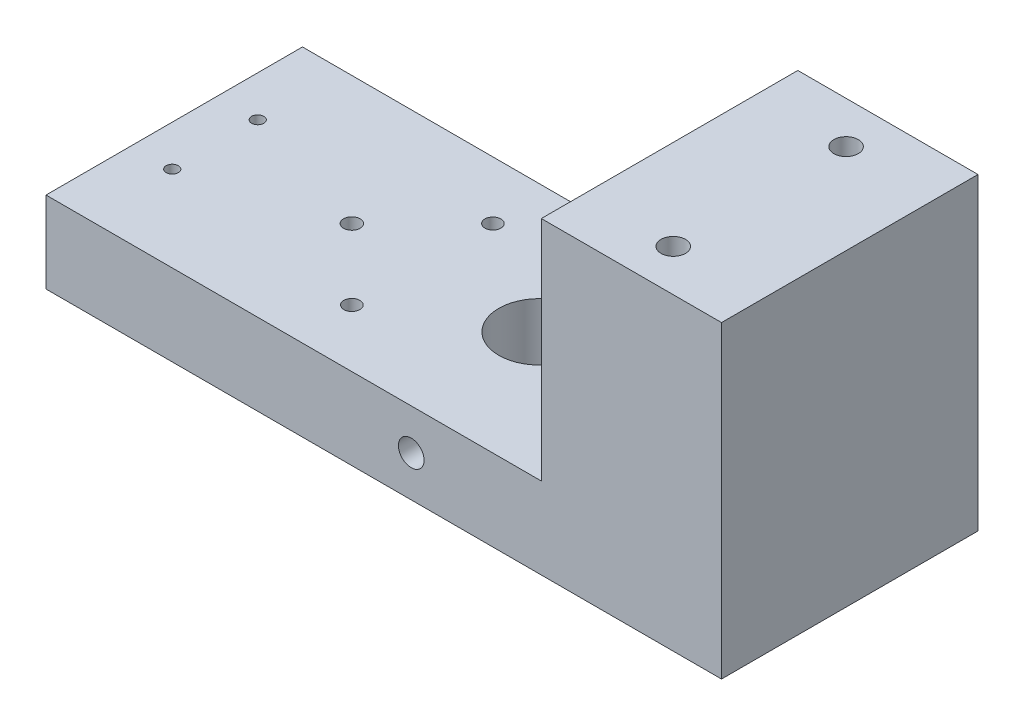
ISO-10303-21;
HEADER;
FILE_DESCRIPTION(('STEP AP214'),'2;1');
FILE_NAME('part.step','',(''),(''),'','','');
FILE_SCHEMA(('AUTOMOTIVE_DESIGN { 1 0 10303 214 1 1 1 1 }'));
ENDSEC;
DATA;
#1=APPLICATION_CONTEXT('core data for automotive mechanical design processes');
#2=APPLICATION_PROTOCOL_DEFINITION('international standard','automotive_design',2000,#1);
#3=PRODUCT_CONTEXT('',#1,'mechanical');
#4=PRODUCT('Part','Part','',(#3));
#5=PRODUCT_RELATED_PRODUCT_CATEGORY('part','',(#4));
#6=PRODUCT_DEFINITION_FORMATION('','',#4);
#7=PRODUCT_DEFINITION_CONTEXT('part definition',#1,'design');
#8=PRODUCT_DEFINITION('design','',#6,#7);
#9=PRODUCT_DEFINITION_SHAPE('','',#8);
#10=(LENGTH_UNIT() NAMED_UNIT(*) SI_UNIT(.MILLI.,.METRE.));
#11=(NAMED_UNIT(*) PLANE_ANGLE_UNIT() SI_UNIT($,.RADIAN.));
#12=(NAMED_UNIT(*) SI_UNIT($,.STERADIAN.) SOLID_ANGLE_UNIT());
#13=UNCERTAINTY_MEASURE_WITH_UNIT(LENGTH_MEASURE(1.E-05),#10,'distance_accuracy_value','');
#14=(GEOMETRIC_REPRESENTATION_CONTEXT(3) GLOBAL_UNCERTAINTY_ASSIGNED_CONTEXT((#13)) GLOBAL_UNIT_ASSIGNED_CONTEXT((#10,
#11,#12)) REPRESENTATION_CONTEXT('',''));
#15=CARTESIAN_POINT('',(0.,0.,0.));
#16=DIRECTION('',(0.,0.,1.));
#17=DIRECTION('',(1.,0.,0.));
#18=AXIS2_PLACEMENT_3D('',#15,#16,#17);
#19=CARTESIAN_POINT('',(105.35,-10.8163637357097,28.0311398221209));
#20=DIRECTION('',(0.,1.,0.));
#21=DIRECTION('',(0.,0.,1.));
#22=AXIS2_PLACEMENT_3D('',#19,#20,#21);
#23=PLANE('',#22);
#24=CARTESIAN_POINT('',(6.35,-10.8163637357097,1.36413982212091));
#25=DIRECTION('',(0.,-1.,0.));
#26=DIRECTION('',(0.,0.,-1.));
#27=AXIS2_PLACEMENT_3D('',#24,#25,#26);
#28=CIRCLE('',#27,0.949999999999999);
#29=CARTESIAN_POINT('',(6.35,-10.8163637357097,0.414139822120907));
#30=VERTEX_POINT('',#29);
#31=EDGE_CURVE('E210',#30,#30,#28,.T.);
#32=ORIENTED_EDGE('',*,*,#31,.F.);
#33=EDGE_LOOP('',(#32));
#34=FACE_BOUND('',#33,.T.);
#35=CARTESIAN_POINT('',(6.35,-10.8163637357097,14.6981398221209));
#36=DIRECTION('',(0.,-1.,0.));
#37=DIRECTION('',(0.,0.,-1.));
#38=AXIS2_PLACEMENT_3D('',#35,#36,#37);
#39=CIRCLE('',#38,0.949999999999999);
#40=CARTESIAN_POINT('',(6.35,-10.8163637357097,13.7481398221209));
#41=VERTEX_POINT('',#40);
#42=EDGE_CURVE('E199',#41,#41,#39,.T.);
#43=ORIENTED_EDGE('',*,*,#42,.F.);
#44=EDGE_LOOP('',(#43));
#45=FACE_BOUND('',#44,.T.);
#46=CARTESIAN_POINT('',(91.3,-10.8163637357097,21.5058398221209));
#47=DIRECTION('',(0.,1.,0.));
#48=DIRECTION('',(0.,0.,1.));
#49=AXIS2_PLACEMENT_3D('',#46,#47,#48);
#50=CIRCLE('',#49,3.75000000000001);
#51=CARTESIAN_POINT('',(91.3,-10.8163637357097,25.2558398221209));
#52=VERTEX_POINT('',#51);
#53=EDGE_CURVE('E188',#52,#52,#50,.T.);
#54=ORIENTED_EDGE('',*,*,#53,.T.);
#55=EDGE_LOOP('',(#54));
#56=FACE_BOUND('',#55,.T.);
#57=CARTESIAN_POINT('',(38.7,-10.8163637357097,19.0311398221209));
#58=DIRECTION('',(0.,1.,0.));
#59=DIRECTION('',(0.,0.,1.));
#60=AXIS2_PLACEMENT_3D('',#57,#58,#59);
#61=CIRCLE('',#60,1.25);
#62=CARTESIAN_POINT('',(38.7,-10.8163637357097,20.2811398221209));
#63=VERTEX_POINT('',#62);
#64=EDGE_CURVE('E136',#63,#63,#61,.T.);
#65=ORIENTED_EDGE('',*,*,#64,.T.);
#66=EDGE_LOOP('',(#65));
#67=FACE_BOUND('',#66,.T.);
#68=CARTESIAN_POINT('',(38.7,-10.8163637357097,-2.96886017787909));
#69=DIRECTION('',(0.,1.,0.));
#70=DIRECTION('',(0.,0.,1.));
#71=AXIS2_PLACEMENT_3D('',#68,#69,#70);
#72=CIRCLE('',#71,1.25);
#73=CARTESIAN_POINT('',(38.7,-10.8163637357097,-1.71886017787909));
#74=VERTEX_POINT('',#73);
#75=EDGE_CURVE('E144',#74,#74,#72,.T.);
#76=ORIENTED_EDGE('',*,*,#75,.T.);
#77=EDGE_LOOP('',(#76));
#78=FACE_BOUND('',#77,.T.);
#79=CARTESIAN_POINT('',(27.7,-10.8163637357097,8.03113982212091));
#80=DIRECTION('',(0.,1.,0.));
#81=DIRECTION('',(0.,0.,1.));
#82=AXIS2_PLACEMENT_3D('',#79,#80,#81);
#83=CIRCLE('',#82,1.29151989841485);
#84=CARTESIAN_POINT('',(27.7,-10.8163637357097,9.32265972053576));
#85=VERTEX_POINT('',#84);
#86=EDGE_CURVE('E150',#85,#85,#83,.T.);
#87=ORIENTED_EDGE('',*,*,#86,.T.);
#88=EDGE_LOOP('',(#87));
#89=FACE_BOUND('',#88,.T.);
#90=CARTESIAN_POINT('',(56.96,-10.8163637357097,8.03113982212091));
#91=DIRECTION('',(0.,1.,0.));
#92=DIRECTION('',(0.,0.,1.));
#93=AXIS2_PLACEMENT_3D('',#90,#91,#92);
#94=CIRCLE('',#93,6.35000000000003);
#95=CARTESIAN_POINT('',(56.96,-10.8163637357097,14.3811398221209));
#96=VERTEX_POINT('',#95);
#97=EDGE_CURVE('E102',#96,#96,#94,.T.);
#98=ORIENTED_EDGE('',*,*,#97,.T.);
#99=EDGE_LOOP('',(#98));
#100=FACE_BOUND('',#99,.T.);
#101=DIRECTION('',(0.,0.,-1.));
#102=VECTOR('',#101,1.);
#103=CARTESIAN_POINT('',(0.,-10.8163637357097,28.0311398221209));
#104=LINE('',#103,#102);
#105=CARTESIAN_POINT('',(0.,-10.8163637357097,28.0311398221209));
#106=VERTEX_POINT('',#105);
#107=CARTESIAN_POINT('',(0.,-10.8163637357097,-11.9688601778791));
#108=VERTEX_POINT('',#107);
#109=EDGE_CURVE('E101',#106,#108,#104,.T.);
#110=ORIENTED_EDGE('',*,*,#109,.T.);
#111=DIRECTION('',(-1.,0.,0.));
#112=VECTOR('',#111,1.);
#113=CARTESIAN_POINT('',(105.35,-10.8163637357097,-11.9688601778791));
#114=LINE('',#113,#112);
#115=CARTESIAN_POINT('',(105.35,-10.8163637357097,-11.9688601778791));
#116=VERTEX_POINT('',#115);
#117=EDGE_CURVE('E44',#116,#108,#114,.T.);
#118=ORIENTED_EDGE('',*,*,#117,.F.);
#119=DIRECTION('',(0.,0.,-1.));
#120=VECTOR('',#119,1.);
#121=CARTESIAN_POINT('',(105.35,-10.8163637357097,28.0311398221209));
#122=LINE('',#121,#120);
#123=CARTESIAN_POINT('',(105.35,-10.8163637357097,28.0311398221209));
#124=VERTEX_POINT('',#123);
#125=EDGE_CURVE('E61',#124,#116,#122,.T.);
#126=ORIENTED_EDGE('',*,*,#125,.F.);
#127=DIRECTION('',(-1.,0.,0.));
#128=VECTOR('',#127,1.);
#129=CARTESIAN_POINT('',(105.35,-10.8163637357097,28.0311398221209));
#130=LINE('',#129,#128);
#131=EDGE_CURVE('E12',#124,#106,#130,.T.);
#132=ORIENTED_EDGE('',*,*,#131,.T.);
#133=EDGE_LOOP('',(#110,#118,#126,#132));
#134=FACE_BOUND('',#133,.T.);
#135=CARTESIAN_POINT('',(91.3,-10.8163637357097,-5.44356017787909));
#136=DIRECTION('',(0.,1.,0.));
#137=DIRECTION('',(0.,0.,1.));
#138=AXIS2_PLACEMENT_3D('',#135,#136,#137);
#139=CIRCLE('',#138,3.75000000000001);
#140=CARTESIAN_POINT('',(91.3,-10.8163637357097,-1.69356017787908));
#141=VERTEX_POINT('',#140);
#142=EDGE_CURVE('E221',#141,#141,#139,.T.);
#143=ORIENTED_EDGE('',*,*,#142,.T.);
#144=EDGE_LOOP('',(#143));
#145=FACE_BOUND('',#144,.T.);
#146=ADVANCED_FACE('F35',(#34,#45,#56,#67,#78,#89,#100,#134,#145),#23,.F.);
#147=CARTESIAN_POINT('',(105.35,1.8836362642903,28.0311398221209));
#148=DIRECTION('',(0.,-1.,0.));
#149=DIRECTION('',(0.,0.,-1.));
#150=AXIS2_PLACEMENT_3D('',#147,#148,#149);
#151=PLANE('',#150);
#152=CARTESIAN_POINT('',(6.35,1.8836362642903,1.36413982212091));
#153=DIRECTION('',(0.,-1.,0.));
#154=DIRECTION('',(0.,0.,-1.));
#155=AXIS2_PLACEMENT_3D('',#152,#153,#154);
#156=CIRCLE('',#155,0.949999999999999);
#157=CARTESIAN_POINT('',(6.35,1.8836362642903,0.414139822120907));
#158=VERTEX_POINT('',#157);
#159=EDGE_CURVE('E39',#158,#158,#156,.T.);
#160=ORIENTED_EDGE('',*,*,#159,.T.);
#161=EDGE_LOOP('',(#160));
#162=FACE_BOUND('',#161,.T.);
#163=CARTESIAN_POINT('',(6.35,1.8836362642903,14.6981398221209));
#164=DIRECTION('',(0.,-1.,0.));
#165=DIRECTION('',(0.,0.,-1.));
#166=AXIS2_PLACEMENT_3D('',#163,#164,#165);
#167=CIRCLE('',#166,0.949999999999999);
#168=CARTESIAN_POINT('',(6.35,1.8836362642903,13.7481398221209));
#169=VERTEX_POINT('',#168);
#170=EDGE_CURVE('E196',#169,#169,#167,.T.);
#171=ORIENTED_EDGE('',*,*,#170,.T.);
#172=EDGE_LOOP('',(#171));
#173=FACE_BOUND('',#172,.T.);
#174=CARTESIAN_POINT('',(56.96,1.8836362642903,8.03113982212091));
#175=DIRECTION('',(0.,1.,0.));
#176=DIRECTION('',(0.,0.,1.));
#177=AXIS2_PLACEMENT_3D('',#174,#175,#176);
#178=CIRCLE('',#177,6.35000000000003);
#179=CARTESIAN_POINT('',(56.96,1.8836362642903,14.3811398221209));
#180=VERTEX_POINT('',#179);
#181=EDGE_CURVE('E106',#180,#180,#178,.T.);
#182=ORIENTED_EDGE('',*,*,#181,.F.);
#183=EDGE_LOOP('',(#182));
#184=FACE_BOUND('',#183,.T.);
#185=CARTESIAN_POINT('',(27.7,1.8836362642903,8.03113982212091));
#186=DIRECTION('',(0.,1.,0.));
#187=DIRECTION('',(0.,0.,1.));
#188=AXIS2_PLACEMENT_3D('',#185,#186,#187);
#189=CIRCLE('',#188,1.29151989841485);
#190=CARTESIAN_POINT('',(27.7,1.8836362642903,9.32265972053576));
#191=VERTEX_POINT('',#190);
#192=EDGE_CURVE('E147',#191,#191,#189,.T.);
#193=ORIENTED_EDGE('',*,*,#192,.F.);
#194=EDGE_LOOP('',(#193));
#195=FACE_BOUND('',#194,.T.);
#196=CARTESIAN_POINT('',(38.7,1.8836362642903,-2.96886017787909));
#197=DIRECTION('',(0.,1.,0.));
#198=DIRECTION('',(0.,0.,1.));
#199=AXIS2_PLACEMENT_3D('',#196,#197,#198);
#200=CIRCLE('',#199,1.25);
#201=CARTESIAN_POINT('',(38.7,1.8836362642903,-1.71886017787909));
#202=VERTEX_POINT('',#201);
#203=EDGE_CURVE('E139',#202,#202,#200,.T.);
#204=ORIENTED_EDGE('',*,*,#203,.F.);
#205=EDGE_LOOP('',(#204));
#206=FACE_BOUND('',#205,.T.);
#207=CARTESIAN_POINT('',(38.7,1.8836362642903,19.0311398221209));
#208=DIRECTION('',(0.,1.,0.));
#209=DIRECTION('',(0.,0.,1.));
#210=AXIS2_PLACEMENT_3D('',#207,#208,#209);
#211=CIRCLE('',#210,1.25);
#212=CARTESIAN_POINT('',(38.7,1.8836362642903,20.2811398221209));
#213=VERTEX_POINT('',#212);
#214=EDGE_CURVE('E140',#213,#213,#211,.T.);
#215=ORIENTED_EDGE('',*,*,#214,.F.);
#216=EDGE_LOOP('',(#215));
#217=FACE_BOUND('',#216,.T.);
#218=DIRECTION('',(0.,0.,1.));
#219=VECTOR('',#218,1.);
#220=CARTESIAN_POINT('',(77.25,1.8836362642903,28.0311398221209));
#221=LINE('',#220,#219);
#222=CARTESIAN_POINT('',(77.25,1.8836362642903,-11.9688601778791));
#223=VERTEX_POINT('',#222);
#224=CARTESIAN_POINT('',(77.25,1.8836362642903,28.0311398221209));
#225=VERTEX_POINT('',#224);
#226=EDGE_CURVE('E52',#223,#225,#221,.T.);
#227=ORIENTED_EDGE('',*,*,#226,.F.);
#228=DIRECTION('',(-1.,0.,0.));
#229=VECTOR('',#228,1.);
#230=CARTESIAN_POINT('',(105.35,1.8836362642903,-11.9688601778791));
#231=LINE('',#230,#229);
#232=CARTESIAN_POINT('',(0.,1.8836362642903,-11.9688601778791));
#233=VERTEX_POINT('',#232);
#234=EDGE_CURVE('E88',#223,#233,#231,.T.);
#235=ORIENTED_EDGE('',*,*,#234,.T.);
#236=DIRECTION('',(0.,0.,1.));
#237=VECTOR('',#236,1.);
#238=CARTESIAN_POINT('',(0.,1.8836362642903,28.0311398221209));
#239=LINE('',#238,#237);
#240=CARTESIAN_POINT('',(0.,1.8836362642903,28.0311398221209));
#241=VERTEX_POINT('',#240);
#242=EDGE_CURVE('E92',#233,#241,#239,.T.);
#243=ORIENTED_EDGE('',*,*,#242,.T.);
#244=DIRECTION('',(-1.,0.,0.));
#245=VECTOR('',#244,1.);
#246=CARTESIAN_POINT('',(105.35,1.8836362642903,28.0311398221209));
#247=LINE('',#246,#245);
#248=EDGE_CURVE('E79',#225,#241,#247,.T.);
#249=ORIENTED_EDGE('',*,*,#248,.F.);
#250=EDGE_LOOP('',(#227,#235,#243,#249));
#251=FACE_BOUND('',#250,.T.);
#252=ADVANCED_FACE('F93',(#162,#173,#184,#195,#206,#217,#251),#151,.F.);
#253=CARTESIAN_POINT('',(105.35,-10.8163637357097,28.0311398221209));
#254=DIRECTION('',(0.,0.,-1.));
#255=DIRECTION('',(-1.,0.,0.));
#256=AXIS2_PLACEMENT_3D('',#253,#254,#255);
#257=PLANE('',#256);
#258=CARTESIAN_POINT('',(56.96,-4.4663637357097,28.0311398221209));
#259=DIRECTION('',(0.,0.,1.));
#260=DIRECTION('',(1.,0.,0.));
#261=AXIS2_PLACEMENT_3D('',#258,#259,#260);
#262=CIRCLE('',#261,1.99999999999999);
#263=CARTESIAN_POINT('',(58.96,-4.4663637357097,28.0311398221209));
#264=VERTEX_POINT('',#263);
#265=EDGE_CURVE('E153',#264,#264,#262,.T.);
#266=ORIENTED_EDGE('',*,*,#265,.F.);
#267=EDGE_LOOP('',(#266));
#268=FACE_BOUND('',#267,.T.);
#269=DIRECTION('',(0.,-1.,0.));
#270=VECTOR('',#269,1.);
#271=CARTESIAN_POINT('',(0.,-10.8163637357097,28.0311398221209));
#272=LINE('',#271,#270);
#273=EDGE_CURVE('E83',#241,#106,#272,.T.);
#274=ORIENTED_EDGE('',*,*,#273,.T.);
#275=ORIENTED_EDGE('',*,*,#131,.F.);
#276=DIRECTION('',(0.,-1.,0.));
#277=VECTOR('',#276,1.);
#278=CARTESIAN_POINT('',(105.35,-10.8163637357097,28.0311398221209));
#279=LINE('',#278,#277);
#280=CARTESIAN_POINT('',(105.35,37.3336362642903,28.0311398221209));
#281=VERTEX_POINT('',#280);
#282=EDGE_CURVE('E97',#281,#124,#279,.T.);
#283=ORIENTED_EDGE('',*,*,#282,.F.);
#284=DIRECTION('',(1.,0.,0.));
#285=VECTOR('',#284,1.);
#286=CARTESIAN_POINT('',(105.35,37.3336362642903,28.0311398221209));
#287=LINE('',#286,#285);
#288=CARTESIAN_POINT('',(77.25,37.3336362642903,28.0311398221209));
#289=VERTEX_POINT('',#288);
#290=EDGE_CURVE('E134',#289,#281,#287,.T.);
#291=ORIENTED_EDGE('',*,*,#290,.F.);
#292=DIRECTION('',(0.,-1.,0.));
#293=VECTOR('',#292,1.);
#294=CARTESIAN_POINT('',(77.25,37.3336362642903,28.0311398221209));
#295=LINE('',#294,#293);
#296=EDGE_CURVE('E87',#289,#225,#295,.T.);
#297=ORIENTED_EDGE('',*,*,#296,.T.);
#298=ORIENTED_EDGE('',*,*,#248,.T.);
#299=EDGE_LOOP('',(#274,#275,#283,#291,#297,#298));
#300=FACE_BOUND('',#299,.T.);
#301=ADVANCED_FACE('F37',(#268,#300),#257,.F.);
#302=CARTESIAN_POINT('',(105.35,-10.8163637357097,-11.9688601778791));
#303=DIRECTION('',(0.,0.,1.));
#304=DIRECTION('',(1.,0.,0.));
#305=AXIS2_PLACEMENT_3D('',#302,#303,#304);
#306=PLANE('',#305);
#307=CARTESIAN_POINT('',(56.96,-4.4663637357097,-11.9688601778791));
#308=DIRECTION('',(0.,0.,1.));
#309=DIRECTION('',(1.,0.,0.));
#310=AXIS2_PLACEMENT_3D('',#307,#308,#309);
#311=CIRCLE('',#310,1.99999999999999);
#312=CARTESIAN_POINT('',(58.96,-4.4663637357097,-11.9688601778791));
#313=VERTEX_POINT('',#312);
#314=EDGE_CURVE('E158',#313,#313,#311,.T.);
#315=ORIENTED_EDGE('',*,*,#314,.T.);
#316=EDGE_LOOP('',(#315));
#317=FACE_BOUND('',#316,.T.);
#318=DIRECTION('',(0.,1.,0.));
#319=VECTOR('',#318,1.);
#320=CARTESIAN_POINT('',(0.,-10.8163637357097,-11.9688601778791));
#321=LINE('',#320,#319);
#322=EDGE_CURVE('E98',#108,#233,#321,.T.);
#323=ORIENTED_EDGE('',*,*,#322,.T.);
#324=ORIENTED_EDGE('',*,*,#234,.F.);
#325=DIRECTION('',(0.,-1.,0.));
#326=VECTOR('',#325,1.);
#327=CARTESIAN_POINT('',(77.25,37.3336362642903,-11.9688601778791));
#328=LINE('',#327,#326);
#329=CARTESIAN_POINT('',(77.25,37.3336362642903,-11.9688601778791));
#330=VERTEX_POINT('',#329);
#331=EDGE_CURVE('E143',#330,#223,#328,.T.);
#332=ORIENTED_EDGE('',*,*,#331,.F.);
#333=DIRECTION('',(-1.,0.,0.));
#334=VECTOR('',#333,1.);
#335=CARTESIAN_POINT('',(105.35,37.3336362642903,-11.9688601778791));
#336=LINE('',#335,#334);
#337=CARTESIAN_POINT('',(105.35,37.3336362642903,-11.9688601778791));
#338=VERTEX_POINT('',#337);
#339=EDGE_CURVE('E176',#338,#330,#336,.T.);
#340=ORIENTED_EDGE('',*,*,#339,.F.);
#341=DIRECTION('',(0.,1.,0.));
#342=VECTOR('',#341,1.);
#343=CARTESIAN_POINT('',(105.35,-10.8163637357097,-11.9688601778791));
#344=LINE('',#343,#342);
#345=EDGE_CURVE('E89',#116,#338,#344,.T.);
#346=ORIENTED_EDGE('',*,*,#345,.F.);
#347=ORIENTED_EDGE('',*,*,#117,.T.);
#348=EDGE_LOOP('',(#323,#324,#332,#340,#346,#347));
#349=FACE_BOUND('',#348,.T.);
#350=ADVANCED_FACE('F177',(#317,#349),#306,.F.);
#351=CARTESIAN_POINT('',(105.35,0.,0.));
#352=DIRECTION('',(-1.,0.,0.));
#353=DIRECTION('',(0.,0.,1.));
#354=AXIS2_PLACEMENT_3D('',#351,#352,#353);
#355=PLANE('',#354);
#356=ORIENTED_EDGE('',*,*,#282,.T.);
#357=ORIENTED_EDGE('',*,*,#125,.T.);
#358=ORIENTED_EDGE('',*,*,#345,.T.);
#359=DIRECTION('',(0.,0.,-1.));
#360=VECTOR('',#359,1.);
#361=CARTESIAN_POINT('',(105.35,37.3336362642903,28.0311398221209));
#362=LINE('',#361,#360);
#363=EDGE_CURVE('E128',#281,#338,#362,.T.);
#364=ORIENTED_EDGE('',*,*,#363,.F.);
#365=EDGE_LOOP('',(#356,#357,#358,#364));
#366=FACE_BOUND('',#365,.T.);
#367=ADVANCED_FACE('F168',(#366),#355,.F.);
#368=CARTESIAN_POINT('',(0.,0.,0.));
#369=DIRECTION('',(-1.,0.,0.));
#370=DIRECTION('',(0.,0.,1.));
#371=AXIS2_PLACEMENT_3D('',#368,#369,#370);
#372=PLANE('',#371);
#373=ORIENTED_EDGE('',*,*,#273,.F.);
#374=ORIENTED_EDGE('',*,*,#242,.F.);
#375=ORIENTED_EDGE('',*,*,#322,.F.);
#376=ORIENTED_EDGE('',*,*,#109,.F.);
#377=EDGE_LOOP('',(#373,#374,#375,#376));
#378=FACE_BOUND('',#377,.T.);
#379=ADVANCED_FACE('F100',(#378),#372,.T.);
#380=CARTESIAN_POINT('',(56.96,-10.8163637357097,8.03113982212091));
#381=DIRECTION('',(0.,1.,0.));
#382=DIRECTION('',(0.,0.,1.));
#383=AXIS2_PLACEMENT_3D('',#380,#381,#382);
#384=CYLINDRICAL_SURFACE('',#383,6.35000000000003);
#385=CARTESIAN_POINT('',(56.96,-6.46636373570969,14.3811398221209));
#386=CARTESIAN_POINT('',(57.0694593825429,-6.46636315216019,14.3811393638948));
#387=CARTESIAN_POINT('',(57.17892504996,-6.45734814860811,14.3782829353326));
#388=CARTESIAN_POINT('',(57.394652473789,-6.42162265321839,14.367168095685));
#389=CARTESIAN_POINT('',(57.5009135458742,-6.3949084093751,14.3589085392124));
#390=CARTESIAN_POINT('',(57.7070898756578,-6.3247765749807,14.3378891876929));
#391=CARTESIAN_POINT('',(57.8070147646735,-6.28138507999049,14.3251364259274));
#392=CARTESIAN_POINT('',(57.9981701783307,-6.17924229543269,14.2964456565778));
#393=CARTESIAN_POINT('',(58.0893992881219,-6.12048851213906,14.2805071319549));
#394=CARTESIAN_POINT('',(58.263431180187,-5.98735237450404,14.2465766601021));
#395=CARTESIAN_POINT('',(58.3459234509452,-5.91257570935357,14.2285394523957));
#396=CARTESIAN_POINT('',(58.4974283183367,-5.75035586327671,14.1927051338673));
#397=CARTESIAN_POINT('',(58.5664383550144,-5.66291028230344,14.1749080692387));
#398=CARTESIAN_POINT('',(58.6907136340879,-5.47513444194802,14.1410820244826));
#399=CARTESIAN_POINT('',(58.7455891676159,-5.37453525848145,14.1251088270316));
#400=CARTESIAN_POINT('',(58.8375138609263,-5.16495174910565,14.0974206589533));
#401=CARTESIAN_POINT('',(58.8745678010479,-5.05596968087042,14.0857045466416));
#402=CARTESIAN_POINT('',(58.9286579724517,-4.83622116816493,14.0683308784789));
#403=CARTESIAN_POINT('',(58.9462708944014,-4.72561082229461,14.062499248996));
#404=CARTESIAN_POINT('',(58.9627808722262,-4.50286317410769,14.0570382094991));
#405=CARTESIAN_POINT('',(58.9616829942381,-4.390726293332,14.0574071206262));
#406=CARTESIAN_POINT('',(58.9412532060964,-4.17289577316673,14.064151953671));
#407=CARTESIAN_POINT('',(58.9226565853829,-4.06712440444851,14.0702856304944));
#408=CARTESIAN_POINT('',(58.8689502137377,-3.86028680142415,14.0874750219124));
#409=CARTESIAN_POINT('',(58.8338386824976,-3.7592210756778,14.0985312671533));
#410=CARTESIAN_POINT('',(58.7475843407955,-3.56292140489735,14.1245041736578));
#411=CARTESIAN_POINT('',(58.6962121586928,-3.46779578969696,14.1394755000755));
#412=CARTESIAN_POINT('',(58.5790540664784,-3.28727501420829,14.1715668798561));
#413=CARTESIAN_POINT('',(58.5132643626156,-3.20188242402421,14.1886874982652));
#414=CARTESIAN_POINT('',(58.3655394805455,-3.03909761248365,14.2241180660656));
#415=CARTESIAN_POINT('',(58.2829979580477,-2.96225861278601,14.2424463864196));
#416=CARTESIAN_POINT('',(58.1059728772725,-2.82337765970185,14.2775289923162));
#417=CARTESIAN_POINT('',(58.0114884069398,-2.76133683746388,14.2942831574736));
#418=CARTESIAN_POINT('',(57.812181054276,-2.65343052633015,14.3245104538535));
#419=CARTESIAN_POINT('',(57.7072812837015,-2.6076988542506,14.3379561728439));
#420=CARTESIAN_POINT('',(57.4907553985711,-2.53469588181359,14.3598536246769));
#421=CARTESIAN_POINT('',(57.3791313716711,-2.50741888373961,14.3683068987899));
#422=CARTESIAN_POINT('',(57.1570200178354,-2.47304626788844,14.3790181512069));
#423=CARTESIAN_POINT('',(57.0466594761204,-2.46520188654811,14.3815058631184));
#424=CARTESIAN_POINT('',(56.826186073638,-2.46780353715623,14.380686239856));
#425=CARTESIAN_POINT('',(56.7160731784895,-2.47824685025365,14.3773797661098));
#426=CARTESIAN_POINT('',(56.5021213622112,-2.51652727424853,14.3654943418153));
#427=CARTESIAN_POINT('',(56.3981941758902,-2.54391723243859,14.3570510242859));
#428=CARTESIAN_POINT('',(56.1964408735438,-2.61476628734308,14.3358821165707));
#429=CARTESIAN_POINT('',(56.0986155162667,-2.6582273778288,14.3231559950814));
#430=CARTESIAN_POINT('',(55.9091635879397,-2.76117998341383,14.2943383851755));
#431=CARTESIAN_POINT('',(55.8177488984655,-2.82103978751125,14.2781717624613));
#432=CARTESIAN_POINT('',(55.6460116701878,-2.95464985401519,14.2443200735441));
#433=CARTESIAN_POINT('',(55.565692195299,-3.02840394005374,14.2266345900894));
#434=CARTESIAN_POINT('',(55.4150650373382,-3.19123103887844,14.1908408025328));
#435=CARTESIAN_POINT('',(55.3452911468554,-3.28080154796059,14.1727441737503));
#436=CARTESIAN_POINT('',(55.2217144996598,-3.4707728188914,14.1389203067502));
#437=CARTESIAN_POINT('',(55.1679115273368,-3.57117343450666,14.1231930365471));
#438=CARTESIAN_POINT('',(55.0781302745159,-3.77977296004372,14.0960611936977));
#439=CARTESIAN_POINT('',(55.0420862184815,-3.88794136682617,14.0846407070316));
#440=CARTESIAN_POINT('',(54.9888565656187,-4.10924669875479,14.0675204072405));
#441=CARTESIAN_POINT('',(54.9716636455011,-4.22238167671033,14.0618183726846));
#442=CARTESIAN_POINT('',(54.9571556062946,-4.44482128554268,14.0570145409737));
#443=CARTESIAN_POINT('',(54.958963656545,-4.55406313821081,14.0576215862555));
#444=CARTESIAN_POINT('',(54.9802847781483,-4.77060434828858,14.0646587617834));
#445=CARTESIAN_POINT('',(54.9997969989334,-4.87790379876515,14.0710886122823));
#446=CARTESIAN_POINT('',(55.0553815865618,-5.08591917543599,14.0888418792734));
#447=CARTESIAN_POINT('',(55.0911992600991,-5.18671008376791,14.1000898816323));
#448=CARTESIAN_POINT('',(55.1781768801283,-5.38093189208786,14.1261917947736));
#449=CARTESIAN_POINT('',(55.2293399826238,-5.47436127307831,14.1410464471945));
#450=CARTESIAN_POINT('',(55.3479283323022,-5.65521907122865,14.1734227869455));
#451=CARTESIAN_POINT('',(55.4159179938944,-5.74226260726669,14.191026875591));
#452=CARTESIAN_POINT('',(55.5652408521045,-5.90398889645954,14.2265436461169));
#453=CARTESIAN_POINT('',(55.6465776403401,-5.97866831162021,14.2444564098951));
#454=CARTESIAN_POINT('',(55.8235497709223,-6.11604232489224,14.2792891270992));
#455=CARTESIAN_POINT('',(55.9195715798797,-6.17825402688922,14.296156028967));
#456=CARTESIAN_POINT('',(56.1212409076753,-6.28557161664789,14.3263248205052));
#457=CARTESIAN_POINT('',(56.226884771544,-6.33068396632251,14.3396280563407));
#458=CARTESIAN_POINT('',(56.4360759154101,-6.39940254673635,14.360290927677));
#459=CARTESIAN_POINT('',(56.5391156190376,-6.42443975847586,14.3680406996929));
#460=CARTESIAN_POINT('',(56.7481019957985,-6.45791889258911,14.3784648356809));
#461=CARTESIAN_POINT('',(56.8540480536235,-6.46636430056035,14.381140265664));
#462=CARTESIAN_POINT('',(56.96,-6.46636373570969,14.3811398221209));
#463=B_SPLINE_CURVE_WITH_KNOTS('',3,(#385,#386,#387,#388,#389,#390,#391,#392,#393,#394,#395,
#396,#397,#398,#399,#400,#401,#402,#403,#404,#405,#406,#407,#408,#409,#410,#411,#412,#413,#414,
#415,#416,#417,#418,#419,#420,#421,#422,#423,#424,#425,#426,#427,#428,#429,#430,#431,#432,#433,
#434,#435,#436,#437,#438,#439,#440,#441,#442,#443,#444,#445,#446,#447,#448,#449,#450,#451,#452,
#453,#454,#455,#456,#457,#458,#459,#460,#461,#462),.UNSPECIFIED.,.T.,.F.,(4,2,2,2,2,2,2,2,2,2,2,
2,2,2,2,2,2,2,2,2,2,2,2,2,2,2,2,2,2,2,2,2,2,2,2,2,2,2,4),(0.,0.327988650558007,
0.656046852642935,0.983593805173067,1.31119396071541,1.64804064739639,1.9849512312221,
2.33034249119073,2.67564105409011,3.01039595432061,3.34506021774283,3.66626171481523,
3.98749784536768,4.31348397544873,4.63955598702783,4.98071999436007,5.32191007136127,
5.66583848283939,6.0096606609629,6.34001323425939,6.67031669785618,6.99225602053108,
7.31423529613712,7.6441408587083,7.97413734250019,8.31743010871826,8.66071824020984,
9.00272515843006,9.34459916667778,9.67076879349634,9.9969227508607,10.3181482438304,
10.6394398466999,10.9734721104888,11.3075944078493,11.6528624869261,11.9979999574323,
12.3155454971876,12.6330243200047),.UNSPECIFIED.);
#464=CARTESIAN_POINT('',(56.96,-6.46636373570969,14.3811398221209));
#465=VERTEX_POINT('',#464);
#466=EDGE_CURVE('E118',#465,#465,#463,.T.);
#467=ORIENTED_EDGE('',*,*,#466,.T.);
#468=EDGE_LOOP('',(#467));
#469=FACE_BOUND('',#468,.T.);
#470=CARTESIAN_POINT('',(58.96,-4.4663637357097,2.00432474282733));
#471=CARTESIAN_POINT('',(58.9599993941926,-4.5756710270825,2.00432417246297));
#472=CARTESIAN_POINT('',(58.9510085259383,-4.68498462046852,2.00131847935141));
#473=CARTESIAN_POINT('',(58.9153875888798,-4.90039720678248,1.98967466757996));
#474=CARTESIAN_POINT('',(58.8887529748816,-5.00649536401711,1.98103509758967));
#475=CARTESIAN_POINT('',(58.8188536954809,-5.21232531339807,1.95919703980789));
#476=CARTESIAN_POINT('',(58.7756188166729,-5.31206813757125,1.94600672190192));
#477=CARTESIAN_POINT('',(58.6738459603531,-5.50291287415733,1.91656479524908));
#478=CARTESIAN_POINT('',(58.6153051987268,-5.59401321040332,1.90031262970773));
#479=CARTESIAN_POINT('',(58.4823943775682,-5.76816625518659,1.86594207729441));
#480=CARTESIAN_POINT('',(58.4075819719967,-5.85087301003619,1.84778090534323));
#481=CARTESIAN_POINT('',(58.2451977625334,-6.00279864488829,1.8120024208091));
#482=CARTESIAN_POINT('',(58.1576241506236,-6.07201561039295,1.7943851857209));
#483=CARTESIAN_POINT('',(57.9697123255692,-6.1965284042512,1.76118946819782));
#484=CARTESIAN_POINT('',(57.8691267556483,-6.25146723996299,1.74566722835848));
#485=CARTESIAN_POINT('',(57.6595709881308,-6.34351248562646,1.71891057858312));
#486=CARTESIAN_POINT('',(57.5506028014638,-6.38062315704619,1.7076751441038));
#487=CARTESIAN_POINT('',(57.3309978910653,-6.43480145287664,1.69106089831635));
#488=CARTESIAN_POINT('',(57.220520367475,-6.45246052647097,1.68550964852833));
#489=CARTESIAN_POINT('',(56.9980403380153,-6.46910907118598,1.68027987007886));
#490=CARTESIAN_POINT('',(56.8860381900858,-6.46810285136244,1.68059998595811));
#491=CARTESIAN_POINT('',(56.6678536464651,-6.44783684987584,1.6869571708446));
#492=CARTESIAN_POINT('',(56.561604893904,-6.42921836681326,1.69279338121142));
#493=CARTESIAN_POINT('',(56.3538249046592,-6.37530955281932,1.7092793645431));
#494=CARTESIAN_POINT('',(56.2522939777247,-6.34001812891839,1.71992945307254));
#495=CARTESIAN_POINT('',(56.0553610331621,-6.25335757094245,1.74511456761347));
#496=CARTESIAN_POINT('',(55.960050208455,-6.20179523322754,1.75969595457373));
#497=CARTESIAN_POINT('',(55.7792354515314,-6.08421197161639,1.79120946559266));
#498=CARTESIAN_POINT('',(55.6937340376029,-6.01818734753828,1.80814219083561));
#499=CARTESIAN_POINT('',(55.5311421187889,-5.87026812458253,1.84340339173354));
#500=CARTESIAN_POINT('',(55.4545603934969,-5.78782035553173,1.8617606100484));
#501=CARTESIAN_POINT('',(55.3161572156831,-5.61108237793967,1.89718532228413));
#502=CARTESIAN_POINT('',(55.2543375594613,-5.51679073032224,1.91425265907521));
#503=CARTESIAN_POINT('',(55.1466087695129,-5.31758413645152,1.94531163206923));
#504=CARTESIAN_POINT('',(55.1008910579138,-5.21255935799412,1.9592655854369));
#505=CARTESIAN_POINT('',(55.0279513968299,-4.99575600734263,1.98207661559387));
#506=CARTESIAN_POINT('',(55.0007226770587,-4.88397992368143,1.99093555788883));
#507=CARTESIAN_POINT('',(54.9665216939892,-4.66172769502448,2.00213850701766));
#508=CARTESIAN_POINT('',(54.9587691953322,-4.55138418859207,2.00473328656337));
#509=CARTESIAN_POINT('',(54.9615480716954,-4.33096435019566,2.0038109186108));
#510=CARTESIAN_POINT('',(54.9720765665832,-4.22088797888108,2.00029473388207));
#511=CARTESIAN_POINT('',(55.0104208170139,-4.00750770056087,1.98779449082931));
#512=CARTESIAN_POINT('',(55.0377170354168,-3.90409979365878,1.97897492166675));
#513=CARTESIAN_POINT('',(55.1082103773991,-3.70334427098773,1.95703670154008));
#514=CARTESIAN_POINT('',(55.1514101213318,-3.60599765700302,1.94391734215777));
#515=CARTESIAN_POINT('',(55.2539152111651,-3.41699906644235,1.9143849306654));
#516=CARTESIAN_POINT('',(55.3136518271409,-3.32559455219121,1.89788729454992));
#517=CARTESIAN_POINT('',(55.4470331992201,-3.15382313438441,1.86363103611511));
#518=CARTESIAN_POINT('',(55.520681625018,-3.07345915281332,1.84587208185493));
#519=CARTESIAN_POINT('',(55.6834922366773,-2.92255092248081,1.81018738350696));
#520=CARTESIAN_POINT('',(55.7731779368283,-2.85256416340517,1.79228622526573));
#521=CARTESIAN_POINT('',(55.9634546174917,-2.7286104444162,1.75908191742392));
#522=CARTESIAN_POINT('',(56.0640451085905,-2.67464276596292,1.74377865130741));
#523=CARTESIAN_POINT('',(56.2726678284958,-2.58477518453453,1.71758027867552));
#524=CARTESIAN_POINT('',(56.3806400395199,-2.54874561801438,1.70665365197431));
#525=CARTESIAN_POINT('',(56.6015170844891,-2.49547947511311,1.69030125287989));
#526=CARTESIAN_POINT('',(56.7144203360442,-2.47823691533091,1.68487372913728));
#527=CARTESIAN_POINT('',(56.9368266626266,-2.46352643902215,1.68024898331271));
#528=CARTESIAN_POINT('',(57.046271867235,-2.46525385712384,1.68079823024927));
#529=CARTESIAN_POINT('',(57.2632419117703,-2.4864839111948,1.68745608644473));
#530=CARTESIAN_POINT('',(57.3707668797982,-2.50598535688877,1.69356432343408));
#531=CARTESIAN_POINT('',(57.5794813908161,-2.56169485392841,1.71057209140031));
#532=CARTESIAN_POINT('',(57.6807346853126,-2.5976845419912,1.72140891242294));
#533=CARTESIAN_POINT('',(57.8758135502307,-2.68515116738797,1.74675663521652));
#534=CARTESIAN_POINT('',(57.9696378336014,-2.73663078091523,1.76126817179911));
#535=CARTESIAN_POINT('',(58.1506966806623,-2.85565639189864,1.79307246934198));
#536=CARTESIAN_POINT('',(58.2375949814026,-2.92369275886032,1.81044353336003));
#537=CARTESIAN_POINT('',(58.3990078538315,-3.07303930405808,1.84578641552072));
#538=CARTESIAN_POINT('',(58.4735186783107,-3.15435348413912,1.86375841347821));
#539=CARTESIAN_POINT('',(58.6105859649345,-3.33124190518096,1.89899083286272));
#540=CARTESIAN_POINT('',(58.6726530576796,-3.42720533647356,1.91620664977893));
#541=CARTESIAN_POINT('',(58.7797139976497,-3.6287208682246,1.94720489143644));
#542=CARTESIAN_POINT('',(58.8247144805448,-3.73426922214326,1.96098864987928));
#543=CARTESIAN_POINT('',(58.893237187937,-3.94321003855408,1.98248034774047));
#544=CARTESIAN_POINT('',(58.9181987559676,-4.04609002646195,1.99058859893103));
#545=CARTESIAN_POINT('',(58.951578333617,-4.25476645678581,2.00151039351286));
#546=CARTESIAN_POINT('',(58.960000586378,-4.36056214411794,2.00432529489899));
#547=CARTESIAN_POINT('',(58.96,-4.4663637357097,2.00432474282733));
#548=B_SPLINE_CURVE_WITH_KNOTS('',3,(#470,#471,#472,#473,#474,#475,#476,#477,#478,#479,#480,
#481,#482,#483,#484,#485,#486,#487,#488,#489,#490,#491,#492,#493,#494,#495,#496,#497,#498,#499,
#500,#501,#502,#503,#504,#505,#506,#507,#508,#509,#510,#511,#512,#513,#514,#515,#516,#517,#518,
#519,#520,#521,#522,#523,#524,#525,#526,#527,#528,#529,#530,#531,#532,#533,#534,#535,#536,#537,
#538,#539,#540,#541,#542,#543,#544,#545,#546,#547),.UNSPECIFIED.,.T.,.F.,(4,2,2,2,2,2,2,2,2,2,2,
2,2,2,2,2,2,2,2,2,2,2,2,2,2,2,2,2,2,2,2,2,2,2,2,2,2,2,4),(0.,0.327530937501898,
0.655146282864026,0.982176500090489,1.30926624499806,1.64670812021067,1.98419785102914,
2.32945360831022,2.67462679795745,3.00898712980464,3.34327027243487,3.66583177205814,
3.98841441965024,4.31498152841548,4.64163228730455,4.98210060956686,5.32261034011033,
5.66704134408283,6.01134615643268,6.34162055248375,6.67184291921616,6.99231634069799,
7.31284258881006,7.64267679354414,7.97259812463583,8.31644176962523,8.66026998908884,
9.00157543261497,9.34277214328856,9.66955393106472,9.996313836816,10.3188660809296,
10.6414740844001,10.9751438824573,11.308914432634,11.6539701164202,11.9988915011943,
12.315999241714,12.6330256179788),.UNSPECIFIED.);
#549=CARTESIAN_POINT('',(58.96,-4.4663637357097,2.00432474282733));
#550=VERTEX_POINT('',#549);
#551=EDGE_CURVE('E160',#550,#550,#548,.T.);
#552=ORIENTED_EDGE('',*,*,#551,.T.);
#553=EDGE_LOOP('',(#552));
#554=FACE_BOUND('',#553,.T.);
#555=ORIENTED_EDGE('',*,*,#97,.F.);
#556=EDGE_LOOP('',(#555));
#557=FACE_BOUND('',#556,.T.);
#558=ORIENTED_EDGE('',*,*,#181,.T.);
#559=EDGE_LOOP('',(#558));
#560=FACE_BOUND('',#559,.T.);
#561=ADVANCED_FACE('F263',(#469,#554,#557,#560),#384,.F.);
#562=CARTESIAN_POINT('',(56.96,-4.4663637357097,28.0311398221209));
#563=DIRECTION('',(0.,0.,1.));
#564=DIRECTION('',(1.,0.,0.));
#565=AXIS2_PLACEMENT_3D('',#562,#563,#564);
#566=CYLINDRICAL_SURFACE('',#565,1.99999999999999);
#567=ORIENTED_EDGE('',*,*,#314,.F.);
#568=EDGE_LOOP('',(#567));
#569=FACE_BOUND('',#568,.T.);
#570=ORIENTED_EDGE('',*,*,#551,.F.);
#571=EDGE_LOOP('',(#570));
#572=FACE_BOUND('',#571,.T.);
#573=ADVANCED_FACE('F267',(#569,#572),#566,.F.);
#574=ORIENTED_EDGE('',*,*,#265,.T.);
#575=EDGE_LOOP('',(#574));
#576=FACE_BOUND('',#575,.T.);
#577=ORIENTED_EDGE('',*,*,#466,.F.);
#578=EDGE_LOOP('',(#577));
#579=FACE_BOUND('',#578,.T.);
#580=ADVANCED_FACE('F269',(#576,#579),#566,.F.);
#581=CARTESIAN_POINT('',(27.7,-10.8163637357097,8.03113982212091));
#582=DIRECTION('',(0.,1.,0.));
#583=DIRECTION('',(0.,0.,1.));
#584=AXIS2_PLACEMENT_3D('',#581,#582,#583);
#585=CYLINDRICAL_SURFACE('',#584,1.29151989841485);
#586=ORIENTED_EDGE('',*,*,#86,.F.);
#587=EDGE_LOOP('',(#586));
#588=FACE_BOUND('',#587,.T.);
#589=ORIENTED_EDGE('',*,*,#192,.T.);
#590=EDGE_LOOP('',(#589));
#591=FACE_BOUND('',#590,.T.);
#592=ADVANCED_FACE('F333',(#588,#591),#585,.F.);
#593=CARTESIAN_POINT('',(38.7,-10.8163637357097,-2.96886017787909));
#594=DIRECTION('',(0.,1.,0.));
#595=DIRECTION('',(0.,0.,1.));
#596=AXIS2_PLACEMENT_3D('',#593,#594,#595);
#597=CYLINDRICAL_SURFACE('',#596,1.25);
#598=ORIENTED_EDGE('',*,*,#75,.F.);
#599=EDGE_LOOP('',(#598));
#600=FACE_BOUND('',#599,.T.);
#601=ORIENTED_EDGE('',*,*,#203,.T.);
#602=EDGE_LOOP('',(#601));
#603=FACE_BOUND('',#602,.T.);
#604=ADVANCED_FACE('F325',(#600,#603),#597,.F.);
#605=CARTESIAN_POINT('',(38.7,-10.8163637357097,19.0311398221209));
#606=DIRECTION('',(0.,1.,0.));
#607=DIRECTION('',(0.,0.,1.));
#608=AXIS2_PLACEMENT_3D('',#605,#606,#607);
#609=CYLINDRICAL_SURFACE('',#608,1.25);
#610=ORIENTED_EDGE('',*,*,#64,.F.);
#611=EDGE_LOOP('',(#610));
#612=FACE_BOUND('',#611,.T.);
#613=ORIENTED_EDGE('',*,*,#214,.T.);
#614=EDGE_LOOP('',(#613));
#615=FACE_BOUND('',#614,.T.);
#616=ADVANCED_FACE('F323',(#612,#615),#609,.F.);
#617=CARTESIAN_POINT('',(77.25,37.3336362642903,28.0311398221209));
#618=DIRECTION('',(1.,0.,0.));
#619=DIRECTION('',(0.,0.,-1.));
#620=AXIS2_PLACEMENT_3D('',#617,#618,#619);
#621=PLANE('',#620);
#622=ORIENTED_EDGE('',*,*,#226,.T.);
#623=ORIENTED_EDGE('',*,*,#296,.F.);
#624=DIRECTION('',(0.,0.,1.));
#625=VECTOR('',#624,1.);
#626=CARTESIAN_POINT('',(77.25,37.3336362642903,28.0311398221209));
#627=LINE('',#626,#625);
#628=EDGE_CURVE('E182',#330,#289,#627,.T.);
#629=ORIENTED_EDGE('',*,*,#628,.F.);
#630=ORIENTED_EDGE('',*,*,#331,.T.);
#631=EDGE_LOOP('',(#622,#623,#629,#630));
#632=FACE_BOUND('',#631,.T.);
#633=ADVANCED_FACE('F245',(#632),#621,.F.);
#634=CARTESIAN_POINT('',(0.,37.3336362642903,0.));
#635=DIRECTION('',(0.,1.,0.));
#636=DIRECTION('',(0.,0.,1.));
#637=AXIS2_PLACEMENT_3D('',#634,#635,#636);
#638=PLANE('',#637);
#639=CARTESIAN_POINT('',(91.3,37.3336362642903,21.5058398221209));
#640=DIRECTION('',(0.,1.,0.));
#641=DIRECTION('',(0.,0.,1.));
#642=AXIS2_PLACEMENT_3D('',#639,#640,#641);
#643=CIRCLE('',#642,1.90500000000001);
#644=CARTESIAN_POINT('',(91.3,37.3336362642903,23.4108398221209));
#645=VERTEX_POINT('',#644);
#646=EDGE_CURVE('E203',#645,#645,#643,.T.);
#647=ORIENTED_EDGE('',*,*,#646,.F.);
#648=EDGE_LOOP('',(#647));
#649=FACE_BOUND('',#648,.T.);
#650=CARTESIAN_POINT('',(91.3,37.3336362642903,-5.44356017787909));
#651=DIRECTION('',(0.,1.,0.));
#652=DIRECTION('',(0.,0.,1.));
#653=AXIS2_PLACEMENT_3D('',#650,#651,#652);
#654=CIRCLE('',#653,1.90500000000001);
#655=CARTESIAN_POINT('',(91.3,37.3336362642903,-3.53856017787908));
#656=VERTEX_POINT('',#655);
#657=EDGE_CURVE('E218',#656,#656,#654,.T.);
#658=ORIENTED_EDGE('',*,*,#657,.F.);
#659=EDGE_LOOP('',(#658));
#660=FACE_BOUND('',#659,.T.);
#661=ORIENTED_EDGE('',*,*,#363,.T.);
#662=ORIENTED_EDGE('',*,*,#339,.T.);
#663=ORIENTED_EDGE('',*,*,#628,.T.);
#664=ORIENTED_EDGE('',*,*,#290,.T.);
#665=EDGE_LOOP('',(#661,#662,#663,#664));
#666=FACE_BOUND('',#665,.T.);
#667=ADVANCED_FACE('F185',(#649,#660,#666),#638,.T.);
#668=CARTESIAN_POINT('',(91.3,13.6836362642903,21.5058398221209));
#669=DIRECTION('',(0.,-1.,0.));
#670=DIRECTION('',(0.,0.,-1.));
#671=AXIS2_PLACEMENT_3D('',#668,#669,#670);
#672=CYLINDRICAL_SURFACE('',#671,3.75000000000001);
#673=CARTESIAN_POINT('',(91.3,13.6836362642903,21.5058398221209));
#674=DIRECTION('',(0.,1.,0.));
#675=DIRECTION('',(0.,0.,1.));
#676=AXIS2_PLACEMENT_3D('',#673,#674,#675);
#677=CIRCLE('',#676,3.75000000000001);
#678=CARTESIAN_POINT('',(91.3,13.6836362642903,25.2558398221209));
#679=VERTEX_POINT('',#678);
#680=EDGE_CURVE('E129',#679,#679,#677,.T.);
#681=ORIENTED_EDGE('',*,*,#680,.T.);
#682=EDGE_LOOP('',(#681));
#683=FACE_BOUND('',#682,.T.);
#684=ORIENTED_EDGE('',*,*,#53,.F.);
#685=EDGE_LOOP('',(#684));
#686=FACE_BOUND('',#685,.T.);
#687=ADVANCED_FACE('F234',(#683,#686),#672,.F.);
#688=CARTESIAN_POINT('',(91.3,13.6836362642903,21.5058398221209));
#689=DIRECTION('',(0.,1.,0.));
#690=DIRECTION('',(0.,0.,1.));
#691=AXIS2_PLACEMENT_3D('',#688,#689,#690);
#692=PLANE('',#691);
#693=CARTESIAN_POINT('',(91.3,13.6836362642903,21.5058398221209));
#694=DIRECTION('',(0.,-1.,0.));
#695=DIRECTION('',(0.,0.,-1.));
#696=AXIS2_PLACEMENT_3D('',#693,#694,#695);
#697=CIRCLE('',#696,1.90500000000001);
#698=CARTESIAN_POINT('',(91.3,13.6836362642903,19.6008398221209));
#699=VERTEX_POINT('',#698);
#700=EDGE_CURVE('E198',#699,#699,#697,.T.);
#701=ORIENTED_EDGE('',*,*,#700,.F.);
#702=EDGE_LOOP('',(#701));
#703=FACE_BOUND('',#702,.T.);
#704=ORIENTED_EDGE('',*,*,#680,.F.);
#705=EDGE_LOOP('',(#704));
#706=FACE_BOUND('',#705,.T.);
#707=ADVANCED_FACE('F236',(#703,#706),#692,.F.);
#708=CARTESIAN_POINT('',(91.3,13.6836362642903,-5.44356017787909));
#709=DIRECTION('',(0.,-1.,0.));
#710=DIRECTION('',(0.,0.,-1.));
#711=AXIS2_PLACEMENT_3D('',#708,#709,#710);
#712=CYLINDRICAL_SURFACE('',#711,3.75000000000001);
#713=CARTESIAN_POINT('',(91.3,13.6836362642903,-5.44356017787909));
#714=DIRECTION('',(0.,1.,0.));
#715=DIRECTION('',(0.,0.,1.));
#716=AXIS2_PLACEMENT_3D('',#713,#714,#715);
#717=CIRCLE('',#716,3.75000000000001);
#718=CARTESIAN_POINT('',(91.3,13.6836362642903,-1.69356017787908));
#719=VERTEX_POINT('',#718);
#720=EDGE_CURVE('E222',#719,#719,#717,.T.);
#721=ORIENTED_EDGE('',*,*,#720,.T.);
#722=EDGE_LOOP('',(#721));
#723=FACE_BOUND('',#722,.T.);
#724=ORIENTED_EDGE('',*,*,#142,.F.);
#725=EDGE_LOOP('',(#724));
#726=FACE_BOUND('',#725,.T.);
#727=ADVANCED_FACE('F242',(#723,#726),#712,.F.);
#728=CARTESIAN_POINT('',(91.3,13.6836362642903,-5.44356017787909));
#729=DIRECTION('',(0.,1.,0.));
#730=DIRECTION('',(0.,0.,1.));
#731=AXIS2_PLACEMENT_3D('',#728,#729,#730);
#732=PLANE('',#731);
#733=CARTESIAN_POINT('',(91.3,13.6836362642903,-5.44356017787909));
#734=DIRECTION('',(0.,-1.,0.));
#735=DIRECTION('',(0.,0.,-1.));
#736=AXIS2_PLACEMENT_3D('',#733,#734,#735);
#737=CIRCLE('',#736,1.90500000000001);
#738=CARTESIAN_POINT('',(91.3,13.6836362642903,-7.3485601778791));
#739=VERTEX_POINT('',#738);
#740=EDGE_CURVE('E215',#739,#739,#737,.T.);
#741=ORIENTED_EDGE('',*,*,#740,.F.);
#742=EDGE_LOOP('',(#741));
#743=FACE_BOUND('',#742,.T.);
#744=ORIENTED_EDGE('',*,*,#720,.F.);
#745=EDGE_LOOP('',(#744));
#746=FACE_BOUND('',#745,.T.);
#747=ADVANCED_FACE('F286',(#743,#746),#732,.F.);
#748=CARTESIAN_POINT('',(91.3,37.3336612642903,-5.44356017787909));
#749=DIRECTION('',(0.,-1.,0.));
#750=DIRECTION('',(0.,0.,-1.));
#751=AXIS2_PLACEMENT_3D('',#748,#749,#750);
#752=CYLINDRICAL_SURFACE('',#751,1.90500000000001);
#753=ORIENTED_EDGE('',*,*,#657,.T.);
#754=EDGE_LOOP('',(#753));
#755=FACE_BOUND('',#754,.T.);
#756=ORIENTED_EDGE('',*,*,#740,.T.);
#757=EDGE_LOOP('',(#756));
#758=FACE_BOUND('',#757,.T.);
#759=ADVANCED_FACE('F292',(#755,#758),#752,.F.);
#760=CARTESIAN_POINT('',(91.3,37.3336612642903,21.5058398221209));
#761=DIRECTION('',(0.,-1.,0.));
#762=DIRECTION('',(0.,0.,-1.));
#763=AXIS2_PLACEMENT_3D('',#760,#761,#762);
#764=CYLINDRICAL_SURFACE('',#763,1.90500000000001);
#765=ORIENTED_EDGE('',*,*,#646,.T.);
#766=EDGE_LOOP('',(#765));
#767=FACE_BOUND('',#766,.T.);
#768=ORIENTED_EDGE('',*,*,#700,.T.);
#769=EDGE_LOOP('',(#768));
#770=FACE_BOUND('',#769,.T.);
#771=ADVANCED_FACE('F298',(#767,#770),#764,.F.);
#772=CARTESIAN_POINT('',(6.35,10.1836362642903,14.6981398221209));
#773=DIRECTION('',(0.,-1.,0.));
#774=DIRECTION('',(0.,0.,-1.));
#775=AXIS2_PLACEMENT_3D('',#772,#773,#774);
#776=CYLINDRICAL_SURFACE('',#775,0.949999999999999);
#777=ORIENTED_EDGE('',*,*,#42,.T.);
#778=EDGE_LOOP('',(#777));
#779=FACE_BOUND('',#778,.T.);
#780=ORIENTED_EDGE('',*,*,#170,.F.);
#781=EDGE_LOOP('',(#780));
#782=FACE_BOUND('',#781,.T.);
#783=ADVANCED_FACE('F302',(#779,#782),#776,.F.);
#784=CARTESIAN_POINT('',(6.35,10.1836362642903,1.36413982212091));
#785=DIRECTION('',(0.,-1.,0.));
#786=DIRECTION('',(0.,0.,-1.));
#787=AXIS2_PLACEMENT_3D('',#784,#785,#786);
#788=CYLINDRICAL_SURFACE('',#787,0.949999999999999);
#789=ORIENTED_EDGE('',*,*,#31,.T.);
#790=EDGE_LOOP('',(#789));
#791=FACE_BOUND('',#790,.T.);
#792=ORIENTED_EDGE('',*,*,#159,.F.);
#793=EDGE_LOOP('',(#792));
#794=FACE_BOUND('',#793,.T.);
#795=ADVANCED_FACE('F306',(#791,#794),#788,.F.);
#796=CLOSED_SHELL('',(#146,#252,#301,#350,#367,#379,#561,#573,#580,#592,#604,#616,#633,#667,
#687,#707,#727,#747,#759,#771,#783,#795));
#797=MANIFOLD_SOLID_BREP('B2',#796);
#798=ADVANCED_BREP_SHAPE_REPRESENTATION('',(#18,#797),#14);
#799=SHAPE_DEFINITION_REPRESENTATION(#9,#798);
ENDSEC;
END-ISO-10303-21;
